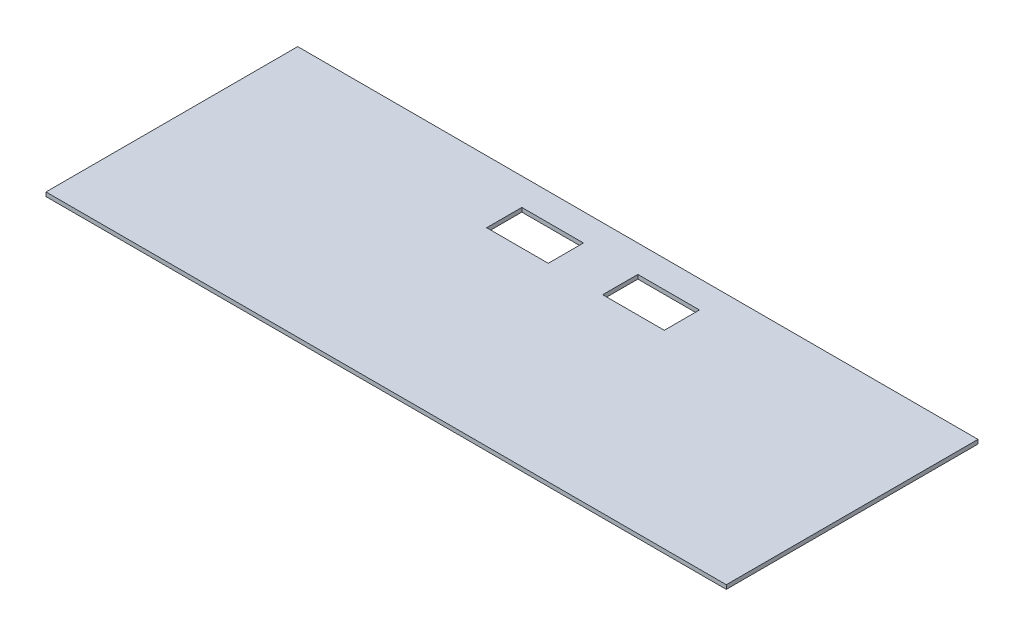
ISO-10303-21;
HEADER;
FILE_DESCRIPTION(('STEP AP214'),'2;1');
FILE_NAME('part.step','',(''),(''),'','','');
FILE_SCHEMA(('AUTOMOTIVE_DESIGN { 1 0 10303 214 1 1 1 1 }'));
ENDSEC;
DATA;
#1=APPLICATION_CONTEXT('core data for automotive mechanical design processes');
#2=APPLICATION_PROTOCOL_DEFINITION('international standard','automotive_design',2000,#1);
#3=PRODUCT_CONTEXT('',#1,'mechanical');
#4=PRODUCT('Part','Part','',(#3));
#5=PRODUCT_RELATED_PRODUCT_CATEGORY('part','',(#4));
#6=PRODUCT_DEFINITION_FORMATION('','',#4);
#7=PRODUCT_DEFINITION_CONTEXT('part definition',#1,'design');
#8=PRODUCT_DEFINITION('design','',#6,#7);
#9=PRODUCT_DEFINITION_SHAPE('','',#8);
#10=(LENGTH_UNIT() NAMED_UNIT(*) SI_UNIT(.MILLI.,.METRE.));
#11=(NAMED_UNIT(*) PLANE_ANGLE_UNIT() SI_UNIT($,.RADIAN.));
#12=(NAMED_UNIT(*) SI_UNIT($,.STERADIAN.) SOLID_ANGLE_UNIT());
#13=UNCERTAINTY_MEASURE_WITH_UNIT(LENGTH_MEASURE(1.E-05),#10,'distance_accuracy_value','');
#14=(GEOMETRIC_REPRESENTATION_CONTEXT(3) GLOBAL_UNCERTAINTY_ASSIGNED_CONTEXT((#13)) GLOBAL_UNIT_ASSIGNED_CONTEXT((#10,
#11,#12)) REPRESENTATION_CONTEXT('',''));
#15=CARTESIAN_POINT('',(0.,0.,0.));
#16=DIRECTION('',(0.,0.,1.));
#17=DIRECTION('',(1.,0.,0.));
#18=AXIS2_PLACEMENT_3D('',#15,#16,#17);
#19=CARTESIAN_POINT('',(250.,3.,-90.0000000000001));
#20=DIRECTION('',(-1.,0.,0.));
#21=DIRECTION('',(0.,0.,1.));
#22=AXIS2_PLACEMENT_3D('',#19,#20,#21);
#23=PLANE('',#22);
#24=DIRECTION('',(0.,0.,-1.));
#25=VECTOR('',#24,1.);
#26=CARTESIAN_POINT('',(250.,0.,-90.0000000000001));
#27=LINE('',#26,#25);
#28=CARTESIAN_POINT('',(250.,0.,95.0000000000001));
#29=VERTEX_POINT('',#28);
#30=CARTESIAN_POINT('',(250.,0.,-90.0000000000001));
#31=VERTEX_POINT('',#30);
#32=EDGE_CURVE('E161',#29,#31,#27,.T.);
#33=ORIENTED_EDGE('',*,*,#32,.T.);
#34=DIRECTION('',(0.,-1.,0.));
#35=VECTOR('',#34,1.);
#36=CARTESIAN_POINT('',(250.,3.,-90.0000000000001));
#37=LINE('',#36,#35);
#38=CARTESIAN_POINT('',(250.,3.,-90.0000000000001));
#39=VERTEX_POINT('',#38);
#40=EDGE_CURVE('E11',#39,#31,#37,.T.);
#41=ORIENTED_EDGE('',*,*,#40,.F.);
#42=DIRECTION('',(0.,0.,-1.));
#43=VECTOR('',#42,1.);
#44=CARTESIAN_POINT('',(250.,3.,-90.0000000000001));
#45=LINE('',#44,#43);
#46=CARTESIAN_POINT('',(250.,3.,95.0000000000001));
#47=VERTEX_POINT('',#46);
#48=EDGE_CURVE('E192',#47,#39,#45,.T.);
#49=ORIENTED_EDGE('',*,*,#48,.F.);
#50=DIRECTION('',(0.,-1.,0.));
#51=VECTOR('',#50,1.);
#52=CARTESIAN_POINT('',(250.,3.,95.0000000000001));
#53=LINE('',#52,#51);
#54=EDGE_CURVE('E202',#47,#29,#53,.T.);
#55=ORIENTED_EDGE('',*,*,#54,.T.);
#56=EDGE_LOOP('',(#33,#41,#49,#55));
#57=FACE_BOUND('',#56,.T.);
#58=ADVANCED_FACE('F33',(#57),#23,.F.);
#59=CARTESIAN_POINT('',(250.,3.,-90.0000000000001));
#60=DIRECTION('',(0.,0.,1.));
#61=DIRECTION('',(1.,0.,0.));
#62=AXIS2_PLACEMENT_3D('',#59,#60,#61);
#63=PLANE('',#62);
#64=DIRECTION('',(-1.,0.,0.));
#65=VECTOR('',#64,1.);
#66=CARTESIAN_POINT('',(250.,0.,-90.0000000000001));
#67=LINE('',#66,#65);
#68=CARTESIAN_POINT('',(-250.,0.,-90.0000000000001));
#69=VERTEX_POINT('',#68);
#70=EDGE_CURVE('E205',#31,#69,#67,.T.);
#71=ORIENTED_EDGE('',*,*,#70,.T.);
#72=DIRECTION('',(0.,-1.,0.));
#73=VECTOR('',#72,1.);
#74=CARTESIAN_POINT('',(-250.,3.,-90.0000000000001));
#75=LINE('',#74,#73);
#76=CARTESIAN_POINT('',(-250.,3.,-90.0000000000001));
#77=VERTEX_POINT('',#76);
#78=EDGE_CURVE('E40',#77,#69,#75,.T.);
#79=ORIENTED_EDGE('',*,*,#78,.F.);
#80=DIRECTION('',(-1.,0.,0.));
#81=VECTOR('',#80,1.);
#82=CARTESIAN_POINT('',(250.,3.,-90.0000000000001));
#83=LINE('',#82,#81);
#84=EDGE_CURVE('E195',#39,#77,#83,.T.);
#85=ORIENTED_EDGE('',*,*,#84,.F.);
#86=ORIENTED_EDGE('',*,*,#40,.T.);
#87=EDGE_LOOP('',(#71,#79,#85,#86));
#88=FACE_BOUND('',#87,.T.);
#89=ADVANCED_FACE('F234',(#88),#63,.F.);
#90=CARTESIAN_POINT('',(-250.,3.,-90.0000000000001));
#91=DIRECTION('',(1.,0.,0.));
#92=DIRECTION('',(0.,0.,-1.));
#93=AXIS2_PLACEMENT_3D('',#90,#91,#92);
#94=PLANE('',#93);
#95=DIRECTION('',(0.,0.,1.));
#96=VECTOR('',#95,1.);
#97=CARTESIAN_POINT('',(-250.,0.,-90.0000000000001));
#98=LINE('',#97,#96);
#99=CARTESIAN_POINT('',(-250.,0.,95.0000000000001));
#100=VERTEX_POINT('',#99);
#101=EDGE_CURVE('E207',#69,#100,#98,.T.);
#102=ORIENTED_EDGE('',*,*,#101,.T.);
#103=DIRECTION('',(0.,-1.,0.));
#104=VECTOR('',#103,1.);
#105=CARTESIAN_POINT('',(-250.,3.,95.0000000000001));
#106=LINE('',#105,#104);
#107=CARTESIAN_POINT('',(-250.,3.,95.0000000000001));
#108=VERTEX_POINT('',#107);
#109=EDGE_CURVE('E212',#108,#100,#106,.T.);
#110=ORIENTED_EDGE('',*,*,#109,.F.);
#111=DIRECTION('',(0.,0.,1.));
#112=VECTOR('',#111,1.);
#113=CARTESIAN_POINT('',(-250.,3.,-90.0000000000001));
#114=LINE('',#113,#112);
#115=EDGE_CURVE('E198',#77,#108,#114,.T.);
#116=ORIENTED_EDGE('',*,*,#115,.F.);
#117=ORIENTED_EDGE('',*,*,#78,.T.);
#118=EDGE_LOOP('',(#102,#110,#116,#117));
#119=FACE_BOUND('',#118,.T.);
#120=ADVANCED_FACE('F219',(#119),#94,.F.);
#121=CARTESIAN_POINT('',(250.,3.,95.0000000000001));
#122=DIRECTION('',(0.,0.,-1.));
#123=DIRECTION('',(-1.,0.,0.));
#124=AXIS2_PLACEMENT_3D('',#121,#122,#123);
#125=PLANE('',#124);
#126=DIRECTION('',(1.,0.,0.));
#127=VECTOR('',#126,1.);
#128=CARTESIAN_POINT('',(250.,0.,95.0000000000001));
#129=LINE('',#128,#127);
#130=EDGE_CURVE('E196',#100,#29,#129,.T.);
#131=ORIENTED_EDGE('',*,*,#130,.T.);
#132=ORIENTED_EDGE('',*,*,#54,.F.);
#133=DIRECTION('',(1.,0.,0.));
#134=VECTOR('',#133,1.);
#135=CARTESIAN_POINT('',(250.,3.,95.0000000000001));
#136=LINE('',#135,#134);
#137=EDGE_CURVE('E200',#108,#47,#136,.T.);
#138=ORIENTED_EDGE('',*,*,#137,.F.);
#139=ORIENTED_EDGE('',*,*,#109,.T.);
#140=EDGE_LOOP('',(#131,#132,#138,#139));
#141=FACE_BOUND('',#140,.T.);
#142=ADVANCED_FACE('F227',(#141),#125,.F.);
#143=CARTESIAN_POINT('',(0.,3.,0.));
#144=DIRECTION('',(0.,-1.,0.));
#145=DIRECTION('',(0.,0.,-1.));
#146=AXIS2_PLACEMENT_3D('',#143,#144,#145);
#147=PLANE('',#146);
#148=DIRECTION('',(0.,0.,1.));
#149=VECTOR('',#148,1.);
#150=CARTESIAN_POINT('',(-65.28,3.,0.));
#151=LINE('',#150,#149);
#152=CARTESIAN_POINT('',(-65.28,3.,-70.0000000000002));
#153=VERTEX_POINT('',#152);
#154=CARTESIAN_POINT('',(-65.28,3.,-44.1500000000002));
#155=VERTEX_POINT('',#154);
#156=EDGE_CURVE('E147',#153,#155,#151,.T.);
#157=ORIENTED_EDGE('',*,*,#156,.F.);
#158=DIRECTION('',(-1.,0.,0.));
#159=VECTOR('',#158,1.);
#160=CARTESIAN_POINT('',(0.,3.,-70.0000000000002));
#161=LINE('',#160,#159);
#162=CARTESIAN_POINT('',(-20.,3.,-70.0000000000002));
#163=VERTEX_POINT('',#162);
#164=EDGE_CURVE('E140',#163,#153,#161,.T.);
#165=ORIENTED_EDGE('',*,*,#164,.F.);
#166=DIRECTION('',(0.,0.,-1.));
#167=VECTOR('',#166,1.);
#168=CARTESIAN_POINT('',(-20.,3.,0.));
#169=LINE('',#168,#167);
#170=CARTESIAN_POINT('',(-20.,3.,-44.1500000000002));
#171=VERTEX_POINT('',#170);
#172=EDGE_CURVE('E151',#171,#163,#169,.T.);
#173=ORIENTED_EDGE('',*,*,#172,.F.);
#174=DIRECTION('',(1.,0.,0.));
#175=VECTOR('',#174,1.);
#176=CARTESIAN_POINT('',(0.,3.,-44.1500000000002));
#177=LINE('',#176,#175);
#178=EDGE_CURVE('E47',#155,#171,#177,.T.);
#179=ORIENTED_EDGE('',*,*,#178,.F.);
#180=EDGE_LOOP('',(#157,#165,#173,#179));
#181=FACE_BOUND('',#180,.T.);
#182=DIRECTION('',(0.,0.,1.));
#183=VECTOR('',#182,1.);
#184=CARTESIAN_POINT('',(20.,3.,0.));
#185=LINE('',#184,#183);
#186=CARTESIAN_POINT('',(20.,3.,-70.0000000000002));
#187=VERTEX_POINT('',#186);
#188=CARTESIAN_POINT('',(20.,3.,-44.1500000000002));
#189=VERTEX_POINT('',#188);
#190=EDGE_CURVE('E164',#187,#189,#185,.T.);
#191=ORIENTED_EDGE('',*,*,#190,.F.);
#192=DIRECTION('',(-1.,0.,0.));
#193=VECTOR('',#192,1.);
#194=CARTESIAN_POINT('',(0.,3.,-70.0000000000002));
#195=LINE('',#194,#193);
#196=CARTESIAN_POINT('',(65.28,3.,-70.0000000000002));
#197=VERTEX_POINT('',#196);
#198=EDGE_CURVE('E167',#197,#187,#195,.T.);
#199=ORIENTED_EDGE('',*,*,#198,.F.);
#200=DIRECTION('',(0.,0.,-1.));
#201=VECTOR('',#200,1.);
#202=CARTESIAN_POINT('',(65.28,3.,0.));
#203=LINE('',#202,#201);
#204=CARTESIAN_POINT('',(65.28,3.,-44.1500000000002));
#205=VERTEX_POINT('',#204);
#206=EDGE_CURVE('E170',#205,#197,#203,.T.);
#207=ORIENTED_EDGE('',*,*,#206,.F.);
#208=DIRECTION('',(1.,0.,0.));
#209=VECTOR('',#208,1.);
#210=CARTESIAN_POINT('',(0.,3.,-44.1500000000002));
#211=LINE('',#210,#209);
#212=EDGE_CURVE('E55',#189,#205,#211,.T.);
#213=ORIENTED_EDGE('',*,*,#212,.F.);
#214=EDGE_LOOP('',(#191,#199,#207,#213));
#215=FACE_BOUND('',#214,.T.);
#216=ORIENTED_EDGE('',*,*,#48,.T.);
#217=ORIENTED_EDGE('',*,*,#84,.T.);
#218=ORIENTED_EDGE('',*,*,#115,.T.);
#219=ORIENTED_EDGE('',*,*,#137,.T.);
#220=EDGE_LOOP('',(#216,#217,#218,#219));
#221=FACE_BOUND('',#220,.T.);
#222=ADVANCED_FACE('F233',(#181,#215,#221),#147,.F.);
#223=CARTESIAN_POINT('',(0.,0.,0.));
#224=DIRECTION('',(0.,-1.,0.));
#225=DIRECTION('',(0.,0.,-1.));
#226=AXIS2_PLACEMENT_3D('',#223,#224,#225);
#227=PLANE('',#226);
#228=DIRECTION('',(-1.,0.,0.));
#229=VECTOR('',#228,1.);
#230=CARTESIAN_POINT('',(0.,0.,-70.0000000000002));
#231=LINE('',#230,#229);
#232=CARTESIAN_POINT('',(-20.,0.,-70.0000000000002));
#233=VERTEX_POINT('',#232);
#234=CARTESIAN_POINT('',(-65.28,0.,-70.0000000000002));
#235=VERTEX_POINT('',#234);
#236=EDGE_CURVE('E137',#233,#235,#231,.T.);
#237=ORIENTED_EDGE('',*,*,#236,.T.);
#238=DIRECTION('',(0.,0.,1.));
#239=VECTOR('',#238,1.);
#240=CARTESIAN_POINT('',(-65.28,0.,0.));
#241=LINE('',#240,#239);
#242=CARTESIAN_POINT('',(-65.28,0.,-44.1500000000002));
#243=VERTEX_POINT('',#242);
#244=EDGE_CURVE('E123',#235,#243,#241,.T.);
#245=ORIENTED_EDGE('',*,*,#244,.T.);
#246=DIRECTION('',(1.,0.,0.));
#247=VECTOR('',#246,1.);
#248=CARTESIAN_POINT('',(0.,0.,-44.1500000000002));
#249=LINE('',#248,#247);
#250=CARTESIAN_POINT('',(-20.,0.,-44.1500000000002));
#251=VERTEX_POINT('',#250);
#252=EDGE_CURVE('E156',#243,#251,#249,.T.);
#253=ORIENTED_EDGE('',*,*,#252,.T.);
#254=DIRECTION('',(0.,0.,-1.));
#255=VECTOR('',#254,1.);
#256=CARTESIAN_POINT('',(-20.,0.,0.));
#257=LINE('',#256,#255);
#258=EDGE_CURVE('E145',#251,#233,#257,.T.);
#259=ORIENTED_EDGE('',*,*,#258,.T.);
#260=EDGE_LOOP('',(#237,#245,#253,#259));
#261=FACE_BOUND('',#260,.T.);
#262=DIRECTION('',(-1.,0.,0.));
#263=VECTOR('',#262,1.);
#264=CARTESIAN_POINT('',(0.,0.,-70.0000000000002));
#265=LINE('',#264,#263);
#266=CARTESIAN_POINT('',(65.28,0.,-70.0000000000002));
#267=VERTEX_POINT('',#266);
#268=CARTESIAN_POINT('',(20.,0.,-70.0000000000002));
#269=VERTEX_POINT('',#268);
#270=EDGE_CURVE('E163',#267,#269,#265,.T.);
#271=ORIENTED_EDGE('',*,*,#270,.T.);
#272=DIRECTION('',(0.,0.,1.));
#273=VECTOR('',#272,1.);
#274=CARTESIAN_POINT('',(20.,0.,0.));
#275=LINE('',#274,#273);
#276=CARTESIAN_POINT('',(20.,0.,-44.1500000000002));
#277=VERTEX_POINT('',#276);
#278=EDGE_CURVE('E185',#269,#277,#275,.T.);
#279=ORIENTED_EDGE('',*,*,#278,.T.);
#280=DIRECTION('',(1.,0.,0.));
#281=VECTOR('',#280,1.);
#282=CARTESIAN_POINT('',(0.,0.,-44.1500000000002));
#283=LINE('',#282,#281);
#284=CARTESIAN_POINT('',(65.28,0.,-44.1500000000002));
#285=VERTEX_POINT('',#284);
#286=EDGE_CURVE('E181',#277,#285,#283,.T.);
#287=ORIENTED_EDGE('',*,*,#286,.T.);
#288=DIRECTION('',(0.,0.,-1.));
#289=VECTOR('',#288,1.);
#290=CARTESIAN_POINT('',(65.28,0.,0.));
#291=LINE('',#290,#289);
#292=EDGE_CURVE('E176',#285,#267,#291,.T.);
#293=ORIENTED_EDGE('',*,*,#292,.T.);
#294=EDGE_LOOP('',(#271,#279,#287,#293));
#295=FACE_BOUND('',#294,.T.);
#296=ORIENTED_EDGE('',*,*,#32,.F.);
#297=ORIENTED_EDGE('',*,*,#130,.F.);
#298=ORIENTED_EDGE('',*,*,#101,.F.);
#299=ORIENTED_EDGE('',*,*,#70,.F.);
#300=EDGE_LOOP('',(#296,#297,#298,#299));
#301=FACE_BOUND('',#300,.T.);
#302=ADVANCED_FACE('F143',(#261,#295,#301),#227,.T.);
#303=CARTESIAN_POINT('',(0.,-52.1392452956504,-70.0000000000002));
#304=DIRECTION('',(0.,0.,-1.));
#305=DIRECTION('',(-1.,0.,0.));
#306=AXIS2_PLACEMENT_3D('',#303,#304,#305);
#307=PLANE('',#306);
#308=DIRECTION('',(0.,1.,0.));
#309=VECTOR('',#308,1.);
#310=CARTESIAN_POINT('',(65.28,-52.1392452956504,-70.0000000000002));
#311=LINE('',#310,#309);
#312=EDGE_CURVE('E179',#267,#197,#311,.T.);
#313=ORIENTED_EDGE('',*,*,#312,.T.);
#314=ORIENTED_EDGE('',*,*,#198,.T.);
#315=DIRECTION('',(0.,1.,0.));
#316=VECTOR('',#315,1.);
#317=CARTESIAN_POINT('',(20.,-52.1392452956504,-70.0000000000002));
#318=LINE('',#317,#316);
#319=EDGE_CURVE('E175',#269,#187,#318,.T.);
#320=ORIENTED_EDGE('',*,*,#319,.F.);
#321=ORIENTED_EDGE('',*,*,#270,.F.);
#322=EDGE_LOOP('',(#313,#314,#320,#321));
#323=FACE_BOUND('',#322,.T.);
#324=ADVANCED_FACE('F246',(#323),#307,.F.);
#325=CARTESIAN_POINT('',(20.,-52.1392452956504,0.));
#326=DIRECTION('',(-1.,0.,0.));
#327=DIRECTION('',(0.,0.,1.));
#328=AXIS2_PLACEMENT_3D('',#325,#326,#327);
#329=PLANE('',#328);
#330=ORIENTED_EDGE('',*,*,#319,.T.);
#331=ORIENTED_EDGE('',*,*,#190,.T.);
#332=DIRECTION('',(0.,1.,0.));
#333=VECTOR('',#332,1.);
#334=CARTESIAN_POINT('',(20.,-52.1392452956504,-44.1500000000002));
#335=LINE('',#334,#333);
#336=EDGE_CURVE('E184',#277,#189,#335,.T.);
#337=ORIENTED_EDGE('',*,*,#336,.F.);
#338=ORIENTED_EDGE('',*,*,#278,.F.);
#339=EDGE_LOOP('',(#330,#331,#337,#338));
#340=FACE_BOUND('',#339,.T.);
#341=ADVANCED_FACE('F252',(#340),#329,.F.);
#342=CARTESIAN_POINT('',(0.,-52.1392452956504,-44.1500000000002));
#343=DIRECTION('',(0.,0.,1.));
#344=DIRECTION('',(1.,0.,0.));
#345=AXIS2_PLACEMENT_3D('',#342,#343,#344);
#346=PLANE('',#345);
#347=ORIENTED_EDGE('',*,*,#336,.T.);
#348=ORIENTED_EDGE('',*,*,#212,.T.);
#349=DIRECTION('',(0.,1.,0.));
#350=VECTOR('',#349,1.);
#351=CARTESIAN_POINT('',(65.28,-52.1392452956504,-44.1500000000002));
#352=LINE('',#351,#350);
#353=EDGE_CURVE('E180',#285,#205,#352,.T.);
#354=ORIENTED_EDGE('',*,*,#353,.F.);
#355=ORIENTED_EDGE('',*,*,#286,.F.);
#356=EDGE_LOOP('',(#347,#348,#354,#355));
#357=FACE_BOUND('',#356,.T.);
#358=ADVANCED_FACE('F256',(#357),#346,.F.);
#359=CARTESIAN_POINT('',(65.28,-52.1392452956504,0.));
#360=DIRECTION('',(1.,0.,0.));
#361=DIRECTION('',(0.,0.,-1.));
#362=AXIS2_PLACEMENT_3D('',#359,#360,#361);
#363=PLANE('',#362);
#364=ORIENTED_EDGE('',*,*,#353,.T.);
#365=ORIENTED_EDGE('',*,*,#206,.T.);
#366=ORIENTED_EDGE('',*,*,#312,.F.);
#367=ORIENTED_EDGE('',*,*,#292,.F.);
#368=EDGE_LOOP('',(#364,#365,#366,#367));
#369=FACE_BOUND('',#368,.T.);
#370=ADVANCED_FACE('F260',(#369),#363,.F.);
#371=CARTESIAN_POINT('',(0.,-52.1392452956504,-70.0000000000002));
#372=DIRECTION('',(0.,0.,-1.));
#373=DIRECTION('',(-1.,0.,0.));
#374=AXIS2_PLACEMENT_3D('',#371,#372,#373);
#375=PLANE('',#374);
#376=DIRECTION('',(0.,1.,0.));
#377=VECTOR('',#376,1.);
#378=CARTESIAN_POINT('',(-20.,-52.1392452956504,-70.0000000000002));
#379=LINE('',#378,#377);
#380=EDGE_CURVE('E154',#233,#163,#379,.T.);
#381=ORIENTED_EDGE('',*,*,#380,.T.);
#382=ORIENTED_EDGE('',*,*,#164,.T.);
#383=DIRECTION('',(0.,1.,0.));
#384=VECTOR('',#383,1.);
#385=CARTESIAN_POINT('',(-65.28,-52.1392452956504,-70.0000000000002));
#386=LINE('',#385,#384);
#387=EDGE_CURVE('E127',#235,#153,#386,.T.);
#388=ORIENTED_EDGE('',*,*,#387,.F.);
#389=ORIENTED_EDGE('',*,*,#236,.F.);
#390=EDGE_LOOP('',(#381,#382,#388,#389));
#391=FACE_BOUND('',#390,.T.);
#392=ADVANCED_FACE('F136',(#391),#375,.F.);
#393=CARTESIAN_POINT('',(-65.28,-52.1392452956504,0.));
#394=DIRECTION('',(-1.,0.,0.));
#395=DIRECTION('',(0.,0.,1.));
#396=AXIS2_PLACEMENT_3D('',#393,#394,#395);
#397=PLANE('',#396);
#398=ORIENTED_EDGE('',*,*,#387,.T.);
#399=ORIENTED_EDGE('',*,*,#156,.T.);
#400=DIRECTION('',(0.,1.,0.));
#401=VECTOR('',#400,1.);
#402=CARTESIAN_POINT('',(-65.28,-52.1392452956504,-44.1500000000002));
#403=LINE('',#402,#401);
#404=EDGE_CURVE('E129',#243,#155,#403,.T.);
#405=ORIENTED_EDGE('',*,*,#404,.F.);
#406=ORIENTED_EDGE('',*,*,#244,.F.);
#407=EDGE_LOOP('',(#398,#399,#405,#406));
#408=FACE_BOUND('',#407,.T.);
#409=ADVANCED_FACE('F125',(#408),#397,.F.);
#410=CARTESIAN_POINT('',(0.,-52.1392452956504,-44.1500000000002));
#411=DIRECTION('',(0.,0.,1.));
#412=DIRECTION('',(1.,0.,0.));
#413=AXIS2_PLACEMENT_3D('',#410,#411,#412);
#414=PLANE('',#413);
#415=ORIENTED_EDGE('',*,*,#404,.T.);
#416=ORIENTED_EDGE('',*,*,#178,.T.);
#417=DIRECTION('',(0.,1.,0.));
#418=VECTOR('',#417,1.);
#419=CARTESIAN_POINT('',(-20.,-52.1392452956504,-44.1500000000002));
#420=LINE('',#419,#418);
#421=EDGE_CURVE('E155',#251,#171,#420,.T.);
#422=ORIENTED_EDGE('',*,*,#421,.F.);
#423=ORIENTED_EDGE('',*,*,#252,.F.);
#424=EDGE_LOOP('',(#415,#416,#422,#423));
#425=FACE_BOUND('',#424,.T.);
#426=ADVANCED_FACE('F268',(#425),#414,.F.);
#427=CARTESIAN_POINT('',(-20.,-52.1392452956504,0.));
#428=DIRECTION('',(1.,0.,0.));
#429=DIRECTION('',(0.,0.,-1.));
#430=AXIS2_PLACEMENT_3D('',#427,#428,#429);
#431=PLANE('',#430);
#432=ORIENTED_EDGE('',*,*,#421,.T.);
#433=ORIENTED_EDGE('',*,*,#172,.T.);
#434=ORIENTED_EDGE('',*,*,#380,.F.);
#435=ORIENTED_EDGE('',*,*,#258,.F.);
#436=EDGE_LOOP('',(#432,#433,#434,#435));
#437=FACE_BOUND('',#436,.T.);
#438=ADVANCED_FACE('F271',(#437),#431,.F.);
#439=CLOSED_SHELL('',(#58,#89,#120,#142,#222,#302,#324,#341,#358,#370,#392,#409,#426,#438));
#440=MANIFOLD_SOLID_BREP('B2',#439);
#441=ADVANCED_BREP_SHAPE_REPRESENTATION('',(#18,#440),#14);
#442=SHAPE_DEFINITION_REPRESENTATION(#9,#441);
ENDSEC;
END-ISO-10303-21;
